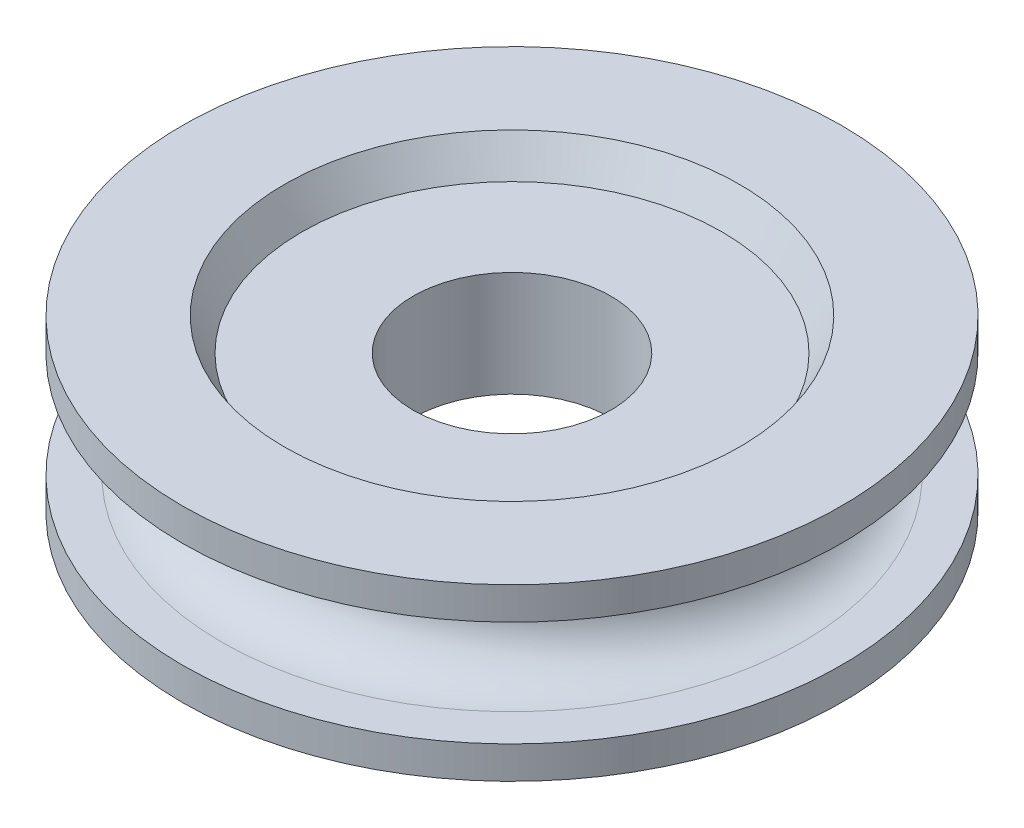
ISO-10303-21;
HEADER;
FILE_DESCRIPTION(('STEP AP214'),'2;1');
FILE_NAME('part.step','',(''),(''),'','','');
FILE_SCHEMA(('AUTOMOTIVE_DESIGN { 1 0 10303 214 1 1 1 1 }'));
ENDSEC;
DATA;
#1=APPLICATION_CONTEXT('core data for automotive mechanical design processes');
#2=APPLICATION_PROTOCOL_DEFINITION('international standard','automotive_design',2000,#1);
#3=PRODUCT_CONTEXT('',#1,'mechanical');
#4=PRODUCT('Part','Part','',(#3));
#5=PRODUCT_RELATED_PRODUCT_CATEGORY('part','',(#4));
#6=PRODUCT_DEFINITION_FORMATION('','',#4);
#7=PRODUCT_DEFINITION_CONTEXT('part definition',#1,'design');
#8=PRODUCT_DEFINITION('design','',#6,#7);
#9=PRODUCT_DEFINITION_SHAPE('','',#8);
#10=(LENGTH_UNIT() NAMED_UNIT(*) SI_UNIT(.MILLI.,.METRE.));
#11=(NAMED_UNIT(*) PLANE_ANGLE_UNIT() SI_UNIT($,.RADIAN.));
#12=(NAMED_UNIT(*) SI_UNIT($,.STERADIAN.) SOLID_ANGLE_UNIT());
#13=UNCERTAINTY_MEASURE_WITH_UNIT(LENGTH_MEASURE(1.E-05),#10,'distance_accuracy_value','');
#14=(GEOMETRIC_REPRESENTATION_CONTEXT(3) GLOBAL_UNCERTAINTY_ASSIGNED_CONTEXT((#13)) GLOBAL_UNIT_ASSIGNED_CONTEXT((#10,
#11,#12)) REPRESENTATION_CONTEXT('',''));
#15=CARTESIAN_POINT('',(0.,0.,0.));
#16=DIRECTION('',(0.,0.,1.));
#17=DIRECTION('',(1.,0.,0.));
#18=AXIS2_PLACEMENT_3D('',#15,#16,#17);
#19=CARTESIAN_POINT('',(0.,0.,0.));
#20=DIRECTION('',(0.,1.,0.));
#21=DIRECTION('',(0.,0.,1.));
#22=AXIS2_PLACEMENT_3D('',#19,#20,#21);
#23=TOROIDAL_SURFACE('',#22,22.,4.);
#24=CARTESIAN_POINT('',(0.,4.,0.));
#25=DIRECTION('',(0.,1.,0.));
#26=DIRECTION('',(0.,0.,1.));
#27=AXIS2_PLACEMENT_3D('',#24,#25,#26);
#28=CIRCLE('',#27,22.);
#29=CARTESIAN_POINT('',(0.,4.,22.));
#30=VERTEX_POINT('',#29);
#31=EDGE_CURVE('E10',#30,#30,#28,.T.);
#32=ORIENTED_EDGE('',*,*,#31,.F.);
#33=EDGE_LOOP('',(#32));
#34=FACE_BOUND('',#33,.T.);
#35=CARTESIAN_POINT('',(0.,-4.,0.));
#36=DIRECTION('',(0.,1.,0.));
#37=DIRECTION('',(0.,0.,1.));
#38=AXIS2_PLACEMENT_3D('',#35,#36,#37);
#39=CIRCLE('',#38,22.);
#40=CARTESIAN_POINT('',(0.,-4.,22.));
#41=VERTEX_POINT('',#40);
#42=EDGE_CURVE('E72',#41,#41,#39,.T.);
#43=ORIENTED_EDGE('',*,*,#42,.T.);
#44=EDGE_LOOP('',(#43));
#45=FACE_BOUND('',#44,.T.);
#46=ADVANCED_FACE('F32',(#34,#45),#23,.F.);
#47=CARTESIAN_POINT('',(22.,4.,0.));
#48=DIRECTION('',(0.,1.,0.));
#49=DIRECTION('',(0.,0.,1.));
#50=AXIS2_PLACEMENT_3D('',#47,#48,#49);
#51=PLANE('',#50);
#52=CARTESIAN_POINT('',(0.,4.,0.));
#53=DIRECTION('',(0.,1.,0.));
#54=DIRECTION('',(0.,0.,1.));
#55=AXIS2_PLACEMENT_3D('',#52,#53,#54);
#56=CIRCLE('',#55,25.);
#57=CARTESIAN_POINT('',(0.,4.,25.));
#58=VERTEX_POINT('',#57);
#59=EDGE_CURVE('E38',#58,#58,#56,.T.);
#60=ORIENTED_EDGE('',*,*,#59,.F.);
#61=EDGE_LOOP('',(#60));
#62=FACE_BOUND('',#61,.T.);
#63=ORIENTED_EDGE('',*,*,#31,.T.);
#64=EDGE_LOOP('',(#63));
#65=FACE_BOUND('',#64,.T.);
#66=ADVANCED_FACE('F133',(#62,#65),#51,.F.);
#67=CARTESIAN_POINT('',(0.,40.9324805830018,0.));
#68=DIRECTION('',(0.,1.,0.));
#69=DIRECTION('',(0.,0.,1.));
#70=AXIS2_PLACEMENT_3D('',#67,#68,#69);
#71=CYLINDRICAL_SURFACE('',#70,25.);
#72=CARTESIAN_POINT('',(0.,6.45914725882037,0.));
#73=DIRECTION('',(0.,1.,0.));
#74=DIRECTION('',(0.,0.,1.));
#75=AXIS2_PLACEMENT_3D('',#72,#73,#74);
#76=CIRCLE('',#75,25.);
#77=CARTESIAN_POINT('',(0.,6.45914725882037,25.));
#78=VERTEX_POINT('',#77);
#79=EDGE_CURVE('E42',#78,#78,#76,.T.);
#80=ORIENTED_EDGE('',*,*,#79,.F.);
#81=EDGE_LOOP('',(#80));
#82=FACE_BOUND('',#81,.T.);
#83=ORIENTED_EDGE('',*,*,#59,.T.);
#84=EDGE_LOOP('',(#83));
#85=FACE_BOUND('',#84,.T.);
#86=ADVANCED_FACE('F128',(#82,#85),#71,.T.);
#87=CARTESIAN_POINT('',(17.2610415697154,6.45914725882036,0.));
#88=DIRECTION('',(0.,-1.,0.));
#89=DIRECTION('',(0.,0.,-1.));
#90=AXIS2_PLACEMENT_3D('',#87,#88,#89);
#91=PLANE('',#90);
#92=CARTESIAN_POINT('',(0.,6.45914725882037,0.));
#93=DIRECTION('',(0.,1.,0.));
#94=DIRECTION('',(0.,0.,1.));
#95=AXIS2_PLACEMENT_3D('',#92,#93,#94);
#96=CIRCLE('',#95,17.2610415697154);
#97=CARTESIAN_POINT('',(0.,6.45914725882037,17.2610415697154));
#98=VERTEX_POINT('',#97);
#99=EDGE_CURVE('E46',#98,#98,#96,.T.);
#100=ORIENTED_EDGE('',*,*,#99,.F.);
#101=EDGE_LOOP('',(#100));
#102=FACE_BOUND('',#101,.T.);
#103=ORIENTED_EDGE('',*,*,#79,.T.);
#104=EDGE_LOOP('',(#103));
#105=FACE_BOUND('',#104,.T.);
#106=ADVANCED_FACE('F122',(#102,#105),#91,.F.);
#107=CARTESIAN_POINT('',(0.,6.45914725882037,0.));
#108=DIRECTION('',(0.,1.,0.));
#109=DIRECTION('',(0.,0.,1.));
#110=AXIS2_PLACEMENT_3D('',#107,#108,#109);
#111=CONICAL_SURFACE('',#110,17.2610415697154,0.495198898675186);
#112=CARTESIAN_POINT('',(0.,4.,0.));
#113=DIRECTION('',(0.,1.,0.));
#114=DIRECTION('',(0.,0.,1.));
#115=AXIS2_PLACEMENT_3D('',#112,#113,#114);
#116=CIRCLE('',#115,15.9328935697482);
#117=CARTESIAN_POINT('',(0.,4.,15.9328935697482));
#118=VERTEX_POINT('',#117);
#119=EDGE_CURVE('E51',#118,#118,#116,.T.);
#120=ORIENTED_EDGE('',*,*,#119,.F.);
#121=EDGE_LOOP('',(#120));
#122=FACE_BOUND('',#121,.T.);
#123=ORIENTED_EDGE('',*,*,#99,.T.);
#124=EDGE_LOOP('',(#123));
#125=FACE_BOUND('',#124,.T.);
#126=ADVANCED_FACE('F116',(#122,#125),#111,.F.);
#127=CARTESIAN_POINT('',(7.5,4.,0.));
#128=DIRECTION('',(0.,-1.,0.));
#129=DIRECTION('',(0.,0.,-1.));
#130=AXIS2_PLACEMENT_3D('',#127,#128,#129);
#131=PLANE('',#130);
#132=CARTESIAN_POINT('',(0.,4.,0.));
#133=DIRECTION('',(0.,1.,0.));
#134=DIRECTION('',(0.,0.,1.));
#135=AXIS2_PLACEMENT_3D('',#132,#133,#134);
#136=CIRCLE('',#135,7.5);
#137=CARTESIAN_POINT('',(0.,4.,7.5));
#138=VERTEX_POINT('',#137);
#139=EDGE_CURVE('E54',#138,#138,#136,.T.);
#140=ORIENTED_EDGE('',*,*,#139,.F.);
#141=EDGE_LOOP('',(#140));
#142=FACE_BOUND('',#141,.T.);
#143=ORIENTED_EDGE('',*,*,#119,.T.);
#144=EDGE_LOOP('',(#143));
#145=FACE_BOUND('',#144,.T.);
#146=ADVANCED_FACE('F110',(#142,#145),#131,.F.);
#147=CARTESIAN_POINT('',(0.,40.9324805830018,0.));
#148=DIRECTION('',(0.,1.,0.));
#149=DIRECTION('',(0.,0.,1.));
#150=AXIS2_PLACEMENT_3D('',#147,#148,#149);
#151=CYLINDRICAL_SURFACE('',#150,7.5);
#152=CARTESIAN_POINT('',(0.,-4.,0.));
#153=DIRECTION('',(0.,1.,0.));
#154=DIRECTION('',(0.,0.,1.));
#155=AXIS2_PLACEMENT_3D('',#152,#153,#154);
#156=CIRCLE('',#155,7.5);
#157=CARTESIAN_POINT('',(0.,-4.,7.5));
#158=VERTEX_POINT('',#157);
#159=EDGE_CURVE('E57',#158,#158,#156,.T.);
#160=ORIENTED_EDGE('',*,*,#159,.F.);
#161=EDGE_LOOP('',(#160));
#162=FACE_BOUND('',#161,.T.);
#163=ORIENTED_EDGE('',*,*,#139,.T.);
#164=EDGE_LOOP('',(#163));
#165=FACE_BOUND('',#164,.T.);
#166=ADVANCED_FACE('F104',(#162,#165),#151,.F.);
#167=CARTESIAN_POINT('',(7.5,-4.,0.));
#168=DIRECTION('',(0.,1.,0.));
#169=DIRECTION('',(0.,0.,1.));
#170=AXIS2_PLACEMENT_3D('',#167,#168,#169);
#171=PLANE('',#170);
#172=CARTESIAN_POINT('',(0.,-4.,0.));
#173=DIRECTION('',(0.,1.,0.));
#174=DIRECTION('',(0.,0.,1.));
#175=AXIS2_PLACEMENT_3D('',#172,#173,#174);
#176=CIRCLE('',#175,15.9328935697482);
#177=CARTESIAN_POINT('',(0.,-4.,15.9328935697482));
#178=VERTEX_POINT('',#177);
#179=EDGE_CURVE('E60',#178,#178,#176,.T.);
#180=ORIENTED_EDGE('',*,*,#179,.F.);
#181=EDGE_LOOP('',(#180));
#182=FACE_BOUND('',#181,.T.);
#183=ORIENTED_EDGE('',*,*,#159,.T.);
#184=EDGE_LOOP('',(#183));
#185=FACE_BOUND('',#184,.T.);
#186=ADVANCED_FACE('F98',(#182,#185),#171,.F.);
#187=CARTESIAN_POINT('',(0.,-4.,0.));
#188=DIRECTION('',(0.,-1.,0.));
#189=DIRECTION('',(0.,0.,-1.));
#190=AXIS2_PLACEMENT_3D('',#187,#188,#189);
#191=CONICAL_SURFACE('',#190,15.9328935697482,0.495198898675186);
#192=CARTESIAN_POINT('',(0.,-6.45914725882037,0.));
#193=DIRECTION('',(0.,1.,0.));
#194=DIRECTION('',(0.,0.,1.));
#195=AXIS2_PLACEMENT_3D('',#192,#193,#194);
#196=CIRCLE('',#195,17.2610415697154);
#197=CARTESIAN_POINT('',(0.,-6.45914725882037,17.2610415697154));
#198=VERTEX_POINT('',#197);
#199=EDGE_CURVE('E63',#198,#198,#196,.T.);
#200=ORIENTED_EDGE('',*,*,#199,.F.);
#201=EDGE_LOOP('',(#200));
#202=FACE_BOUND('',#201,.T.);
#203=ORIENTED_EDGE('',*,*,#179,.T.);
#204=EDGE_LOOP('',(#203));
#205=FACE_BOUND('',#204,.T.);
#206=ADVANCED_FACE('F92',(#202,#205),#191,.F.);
#207=CARTESIAN_POINT('',(17.2610415697154,-6.45914725882036,0.));
#208=DIRECTION('',(0.,1.,0.));
#209=DIRECTION('',(0.,0.,1.));
#210=AXIS2_PLACEMENT_3D('',#207,#208,#209);
#211=PLANE('',#210);
#212=CARTESIAN_POINT('',(0.,-6.45914725882037,0.));
#213=DIRECTION('',(0.,1.,0.));
#214=DIRECTION('',(0.,0.,1.));
#215=AXIS2_PLACEMENT_3D('',#212,#213,#214);
#216=CIRCLE('',#215,25.);
#217=CARTESIAN_POINT('',(0.,-6.45914725882037,25.));
#218=VERTEX_POINT('',#217);
#219=EDGE_CURVE('E66',#218,#218,#216,.T.);
#220=ORIENTED_EDGE('',*,*,#219,.F.);
#221=EDGE_LOOP('',(#220));
#222=FACE_BOUND('',#221,.T.);
#223=ORIENTED_EDGE('',*,*,#199,.T.);
#224=EDGE_LOOP('',(#223));
#225=FACE_BOUND('',#224,.T.);
#226=ADVANCED_FACE('F86',(#222,#225),#211,.F.);
#227=CARTESIAN_POINT('',(0.,40.9324805830018,0.));
#228=DIRECTION('',(0.,1.,0.));
#229=DIRECTION('',(0.,0.,1.));
#230=AXIS2_PLACEMENT_3D('',#227,#228,#229);
#231=CYLINDRICAL_SURFACE('',#230,25.);
#232=CARTESIAN_POINT('',(0.,-4.,0.));
#233=DIRECTION('',(0.,1.,0.));
#234=DIRECTION('',(0.,0.,1.));
#235=AXIS2_PLACEMENT_3D('',#232,#233,#234);
#236=CIRCLE('',#235,25.);
#237=CARTESIAN_POINT('',(0.,-4.,25.));
#238=VERTEX_POINT('',#237);
#239=EDGE_CURVE('E69',#238,#238,#236,.T.);
#240=ORIENTED_EDGE('',*,*,#239,.F.);
#241=EDGE_LOOP('',(#240));
#242=FACE_BOUND('',#241,.T.);
#243=ORIENTED_EDGE('',*,*,#219,.T.);
#244=EDGE_LOOP('',(#243));
#245=FACE_BOUND('',#244,.T.);
#246=ADVANCED_FACE('F80',(#242,#245),#231,.T.);
#247=CARTESIAN_POINT('',(22.,-4.,0.));
#248=DIRECTION('',(0.,-1.,0.));
#249=DIRECTION('',(0.,0.,-1.));
#250=AXIS2_PLACEMENT_3D('',#247,#248,#249);
#251=PLANE('',#250);
#252=ORIENTED_EDGE('',*,*,#42,.F.);
#253=EDGE_LOOP('',(#252));
#254=FACE_BOUND('',#253,.T.);
#255=ORIENTED_EDGE('',*,*,#239,.T.);
#256=EDGE_LOOP('',(#255));
#257=FACE_BOUND('',#256,.T.);
#258=ADVANCED_FACE('F77',(#254,#257),#251,.F.);
#259=CLOSED_SHELL('',(#46,#66,#86,#106,#126,#146,#166,#186,#206,#226,#246,#258));
#260=MANIFOLD_SOLID_BREP('B2',#259);
#261=ADVANCED_BREP_SHAPE_REPRESENTATION('',(#18,#260),#14);
#262=SHAPE_DEFINITION_REPRESENTATION(#9,#261);
ENDSEC;
END-ISO-10303-21;
